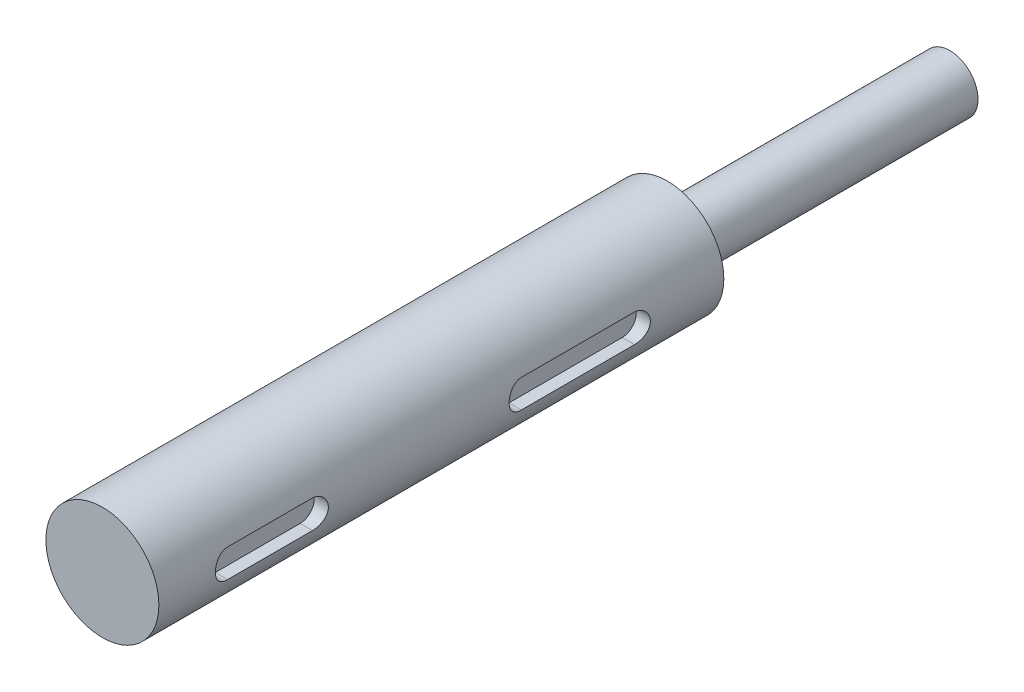
ISO-10303-21;
HEADER;
FILE_DESCRIPTION(('STEP AP214'),'2;1');
FILE_NAME('part.step','',(''),(''),'','','');
FILE_SCHEMA(('AUTOMOTIVE_DESIGN { 1 0 10303 214 1 1 1 1 }'));
ENDSEC;
DATA;
#1=APPLICATION_CONTEXT('core data for automotive mechanical design processes');
#2=APPLICATION_PROTOCOL_DEFINITION('international standard','automotive_design',2000,#1);
#3=PRODUCT_CONTEXT('',#1,'mechanical');
#4=PRODUCT('Part','Part','',(#3));
#5=PRODUCT_RELATED_PRODUCT_CATEGORY('part','',(#4));
#6=PRODUCT_DEFINITION_FORMATION('','',#4);
#7=PRODUCT_DEFINITION_CONTEXT('part definition',#1,'design');
#8=PRODUCT_DEFINITION('design','',#6,#7);
#9=PRODUCT_DEFINITION_SHAPE('','',#8);
#10=(LENGTH_UNIT() NAMED_UNIT(*) SI_UNIT(.MILLI.,.METRE.));
#11=(NAMED_UNIT(*) PLANE_ANGLE_UNIT() SI_UNIT($,.RADIAN.));
#12=(NAMED_UNIT(*) SI_UNIT($,.STERADIAN.) SOLID_ANGLE_UNIT());
#13=UNCERTAINTY_MEASURE_WITH_UNIT(LENGTH_MEASURE(1.E-05),#10,'distance_accuracy_value','');
#14=(GEOMETRIC_REPRESENTATION_CONTEXT(3) GLOBAL_UNCERTAINTY_ASSIGNED_CONTEXT((#13)) GLOBAL_UNIT_ASSIGNED_CONTEXT((#10,
#11,#12)) REPRESENTATION_CONTEXT('',''));
#15=CARTESIAN_POINT('',(0.,0.,0.));
#16=DIRECTION('',(0.,0.,1.));
#17=DIRECTION('',(1.,0.,0.));
#18=AXIS2_PLACEMENT_3D('',#15,#16,#17);
#19=CARTESIAN_POINT('',(0.,0.,40.));
#20=DIRECTION('',(0.,0.,-1.));
#21=DIRECTION('',(-1.,0.,0.));
#22=AXIS2_PLACEMENT_3D('',#19,#20,#21);
#23=CYLINDRICAL_SURFACE('',#22,4.);
#24=CARTESIAN_POINT('',(0.,0.,40.));
#25=DIRECTION('',(0.,0.,1.));
#26=DIRECTION('',(1.,0.,0.));
#27=AXIS2_PLACEMENT_3D('',#24,#25,#26);
#28=CIRCLE('',#27,4.);
#29=CARTESIAN_POINT('',(4.,0.,40.));
#30=VERTEX_POINT('',#29);
#31=EDGE_CURVE('E181',#30,#30,#28,.T.);
#32=ORIENTED_EDGE('',*,*,#31,.F.);
#33=EDGE_LOOP('',(#32));
#34=FACE_BOUND('',#33,.T.);
#35=CARTESIAN_POINT('',(0.,0.,0.));
#36=DIRECTION('',(0.,0.,1.));
#37=DIRECTION('',(1.,0.,0.));
#38=AXIS2_PLACEMENT_3D('',#35,#36,#37);
#39=CIRCLE('',#38,4.);
#40=CARTESIAN_POINT('',(4.,0.,0.));
#41=VERTEX_POINT('',#40);
#42=EDGE_CURVE('E175',#41,#41,#39,.T.);
#43=ORIENTED_EDGE('',*,*,#42,.T.);
#44=EDGE_LOOP('',(#43));
#45=FACE_BOUND('',#44,.T.);
#46=DIRECTION('',(0.,0.,-1.));
#47=VECTOR('',#46,1.);
#48=CARTESIAN_POINT('',(3.87298334620741,-1.00000000000001,40.));
#49=LINE('',#48,#47);
#50=CARTESIAN_POINT('',(3.87298334620741,-1.,14.2));
#51=VERTEX_POINT('',#50);
#52=CARTESIAN_POINT('',(3.87298334620742,-1.,6.2));
#53=VERTEX_POINT('',#52);
#54=EDGE_CURVE('E248',#51,#53,#49,.T.);
#55=ORIENTED_EDGE('',*,*,#54,.F.);
#56=CARTESIAN_POINT('',(4.,0.,15.2));
#57=CARTESIAN_POINT('',(3.99999906578675,-0.0552507257798222,15.1999984495079));
#58=CARTESIAN_POINT('',(3.99884385421219,-0.110518771887177,15.1954056328175));
#59=CARTESIAN_POINT('',(3.99434742553261,-0.21947088251369,15.177183232462));
#60=CARTESIAN_POINT('',(3.99100496946645,-0.273154031247161,15.1635485269748));
#61=CARTESIAN_POINT('',(3.98250417554693,-0.37734724812172,15.1277071643586));
#62=CARTESIAN_POINT('',(3.97734801894724,-0.42786104228667,15.1055108008565));
#63=CARTESIAN_POINT('',(3.96576895871728,-0.524448087936286,15.0532124066368));
#64=CARTESIAN_POINT('',(3.95934601236033,-0.570521189565841,15.023110109254));
#65=CARTESIAN_POINT('',(3.94578275727867,-0.657867951533948,14.9551994735639));
#66=CARTESIAN_POINT('',(3.93863138099022,-0.699037126707382,14.9172589500272));
#67=CARTESIAN_POINT('',(3.92449080078353,-0.774499284802204,14.8350318633941));
#68=CARTESIAN_POINT('',(3.91750161525565,-0.808791491299425,14.7907445847023));
#69=CARTESIAN_POINT('',(3.9043651713314,-0.870017695199357,14.6962698488417));
#70=CARTESIAN_POINT('',(3.89823196313737,-0.896834810616906,14.6460045127931));
#71=CARTESIAN_POINT('',(3.88766329874815,-0.941597939033687,14.5415010588944));
#72=CARTESIAN_POINT('',(3.88322757115192,-0.95954537029289,14.4872635777828));
#73=CARTESIAN_POINT('',(3.87666984478367,-0.985703224536195,14.3775043345317));
#74=CARTESIAN_POINT('',(3.87450327383617,-0.994101512222227,14.3220300693001));
#75=CARTESIAN_POINT('',(3.8725957502516,-1.00150785004524,14.2104209539907));
#76=CARTESIAN_POINT('',(3.87285440299096,-1.00051742787865,14.1542862128676));
#77=CARTESIAN_POINT('',(3.87572803664412,-0.989324349759522,14.0443894615037));
#78=CARTESIAN_POINT('',(3.87828575334586,-0.979345560127015,13.9906029190233));
#79=CARTESIAN_POINT('',(3.88537806450989,-0.950816124602073,13.8854926327258));
#80=CARTESIAN_POINT('',(3.88991279980464,-0.932264868046284,13.8341690646473));
#81=CARTESIAN_POINT('',(3.90050075936124,-0.886926318624771,13.7348413224986));
#82=CARTESIAN_POINT('',(3.90656884979614,-0.860057778155276,13.6868758854736));
#83=CARTESIAN_POINT('',(3.91953140564257,-0.798904184009971,13.5960541934954));
#84=CARTESIAN_POINT('',(3.9264260155649,-0.764617832539227,13.5531988346218));
#85=CARTESIAN_POINT('',(3.94050587026521,-0.688442283120812,13.4725309228704));
#86=CARTESIAN_POINT('',(3.94769379651981,-0.646364172110574,13.4348970066258));
#87=CARTESIAN_POINT('',(3.96137310385857,-0.556407945002467,13.3671858383574));
#88=CARTESIAN_POINT('',(3.96786446366277,-0.508529651805296,13.3371088171576));
#89=CARTESIAN_POINT('',(3.97945154729455,-0.408077259120928,13.2852996091837));
#90=CARTESIAN_POINT('',(3.9845424008515,-0.355487595472417,13.2635964398304));
#91=CARTESIAN_POINT('',(3.99271944660945,-0.247250672095256,13.2293884628603));
#92=CARTESIAN_POINT('',(3.99580602226187,-0.191603999433657,13.2168818957212));
#93=CARTESIAN_POINT('',(3.9995699951425,-0.0803599802600182,13.2016949562941));
#94=CARTESIAN_POINT('',(4.00030702338852,-0.0247978133254736,13.1987713159498));
#95=CARTESIAN_POINT('',(3.999458698763,0.0860219165343381,13.2021660013703));
#96=CARTESIAN_POINT('',(3.99787355494564,0.141279506429729,13.2084834951994));
#97=CARTESIAN_POINT('',(3.99259720751571,0.249076179184327,13.2299806055943));
#98=CARTESIAN_POINT('',(3.98893756123874,0.301643412645835,13.2450275089847));
#99=CARTESIAN_POINT('',(3.97992471089423,0.403504861635006,13.2834047226856));
#100=CARTESIAN_POINT('',(3.97457133579928,0.452798746021755,13.3067358695421));
#101=CARTESIAN_POINT('',(3.96262205284207,0.547682089619897,13.3614907525832));
#102=CARTESIAN_POINT('',(3.95600578244621,0.593190294557219,13.3930507415978));
#103=CARTESIAN_POINT('',(3.94229672791613,0.678351075762163,13.4631932725313));
#104=CARTESIAN_POINT('',(3.93520386167803,0.718002639315338,13.5017770264113));
#105=CARTESIAN_POINT('',(3.92112637973847,0.79132704538182,13.5860013072296));
#106=CARTESIAN_POINT('',(3.91414869458187,0.824829245081354,13.6317918020016));
#107=CARTESIAN_POINT('',(3.90128585584826,0.883673839341797,13.7284884229771));
#108=CARTESIAN_POINT('',(3.89540065378017,0.909016596105289,13.7793943219732));
#109=CARTESIAN_POINT('',(3.88545396489777,0.950634280406193,13.8846038149421));
#110=CARTESIAN_POINT('',(3.88138170194604,0.966962931102708,13.9388850855627));
#111=CARTESIAN_POINT('',(3.87551162726789,0.990230439969184,14.0495397585927));
#112=CARTESIAN_POINT('',(3.87371331813291,0.997171351652437,14.1059127006883));
#113=CARTESIAN_POINT('',(3.87263267469304,1.00135906022266,14.2174140159035));
#114=CARTESIAN_POINT('',(3.87327955152176,0.998878598520077,14.2725316234165));
#115=CARTESIAN_POINT('',(3.87685272671895,0.98491818554191,14.3815359257787));
#116=CARTESIAN_POINT('',(3.87977897927904,0.973438415124511,14.4354226453424));
#117=CARTESIAN_POINT('',(3.88754173788482,0.94195421296186,14.5401389727103));
#118=CARTESIAN_POINT('',(3.89236676824206,0.922000936453581,14.5909848701601));
#119=CARTESIAN_POINT('',(3.90338503816552,0.874176609070045,14.6886435884758));
#120=CARTESIAN_POINT('',(3.90957846747182,0.84630446002279,14.7354558487913));
#121=CARTESIAN_POINT('',(3.92283756175675,0.782578499091421,14.8250364193347));
#122=CARTESIAN_POINT('',(3.92992176554505,0.746535441941499,14.8676673822826));
#123=CARTESIAN_POINT('',(3.94405351497524,0.667859580793153,14.9463646965303));
#124=CARTESIAN_POINT('',(3.95110105151373,0.625225214174094,14.982429486742));
#125=CARTESIAN_POINT('',(3.96451770431775,0.533645057801725,15.0476075390431));
#126=CARTESIAN_POINT('',(3.97087222243912,0.484598948210922,15.0765830757811));
#127=CARTESIAN_POINT('',(3.98203283316745,0.382177373006982,15.1258316419604));
#128=CARTESIAN_POINT('',(3.98684003466521,0.328805042291158,15.146110907099));
#129=CARTESIAN_POINT('',(3.99365373043694,0.229606835495646,15.1743812202198));
#130=CARTESIAN_POINT('',(3.9960172336846,0.184253447272044,15.183967495369));
#131=CARTESIAN_POINT('',(3.99919070154632,0.0926040476908542,15.196777295748));
#132=CARTESIAN_POINT('',(4.00000078300596,0.0463081074950761,15.2000012995369));
#133=CARTESIAN_POINT('',(4.,0.,15.2));
#134=B_SPLINE_CURVE_WITH_KNOTS('',3,(#56,#57,#58,#59,#60,#61,#62,#63,#64,#65,#66,#67,#68,#69,
#70,#71,#72,#73,#74,#75,#76,#77,#78,#79,#80,#81,#82,#83,#84,#85,#86,#87,#88,#89,#90,#91,#92,#93,
#94,#95,#96,#97,#98,#99,#100,#101,#102,#103,#104,#105,#106,#107,#108,#109,#110,#111,#112,#113,
#114,#115,#116,#117,#118,#119,#120,#121,#122,#123,#124,#125,#126,#127,#128,#129,#130,#131,#132,
#133),.UNSPECIFIED.,.T.,.F.,(4,2,2,2,2,2,2,2,2,2,2,2,2,2,2,2,2,2,2,2,2,2,2,2,2,2,2,2,2,2,2,2,2,
2,2,2,2,2,4),(0.,0.16558247498126,0.331258825175933,0.49673660152407,0.662219960112885,
0.830762902914261,0.999324863867079,1.17039098363871,1.34142974112912,1.50904196732954,
1.67662692075131,1.84014998004679,2.00368468977359,2.16887018582586,2.33408460557442,
2.50401000646013,2.67394059705498,2.84445486006076,3.01493649125762,3.18105539299518,
3.34715934075162,3.51080183009358,3.67446084881527,3.84102391710235,4.00761575338679,
4.17829672802984,4.34897012499672,4.51861503076024,4.68822282168272,4.85295853599075,
5.0176909397069,5.18144267039631,5.34521712091267,5.51326384273274,5.68135046513612,
5.85248123666392,6.02348909214233,6.16228161961432,6.3010637069536),.UNSPECIFIED.);
#135=CARTESIAN_POINT('',(3.87298334620742,0.999999999999998,14.2));
#136=VERTEX_POINT('',#135);
#137=EDGE_CURVE('E194',#136,#51,#134,.T.);
#138=ORIENTED_EDGE('',*,*,#137,.F.);
#139=DIRECTION('',(0.,0.,-1.));
#140=VECTOR('',#139,1.);
#141=CARTESIAN_POINT('',(3.87298334620742,0.999999999999991,40.));
#142=LINE('',#141,#140);
#143=CARTESIAN_POINT('',(3.87298334620742,1.,6.2));
#144=VERTEX_POINT('',#143);
#145=EDGE_CURVE('E283',#144,#136,#142,.F.);
#146=ORIENTED_EDGE('',*,*,#145,.F.);
#147=CARTESIAN_POINT('',(4.,0.,7.2));
#148=CARTESIAN_POINT('',(3.99999906578675,-0.0552507257798204,7.19999844950789));
#149=CARTESIAN_POINT('',(3.99884385421219,-0.110518771887175,7.19540563281747));
#150=CARTESIAN_POINT('',(3.99434742553261,-0.219470882513688,7.177183232462));
#151=CARTESIAN_POINT('',(3.99100496946645,-0.273154031247159,7.16354852697477));
#152=CARTESIAN_POINT('',(3.98250417554693,-0.377347248121718,7.12770716435861));
#153=CARTESIAN_POINT('',(3.97734801894724,-0.427861042286669,7.10551080085648));
#154=CARTESIAN_POINT('',(3.96576895871729,-0.524448087936285,7.05321240663678));
#155=CARTESIAN_POINT('',(3.95934601236034,-0.57052118956584,7.02311010925404));
#156=CARTESIAN_POINT('',(3.94578275727867,-0.657867951533947,6.95519947356386));
#157=CARTESIAN_POINT('',(3.93863138099022,-0.699037126707381,6.91725895002721));
#158=CARTESIAN_POINT('',(3.92449080078353,-0.774499284802203,6.83503186339405));
#159=CARTESIAN_POINT('',(3.91750161525565,-0.808791491299423,6.79074458470234));
#160=CARTESIAN_POINT('',(3.9043651713314,-0.870017695199355,6.69626984884171));
#161=CARTESIAN_POINT('',(3.89823196313737,-0.896834810616904,6.64600451279306));
#162=CARTESIAN_POINT('',(3.88766329874815,-0.941597939033685,6.54150105889443));
#163=CARTESIAN_POINT('',(3.88322757115192,-0.959545370292889,6.48726357778282));
#164=CARTESIAN_POINT('',(3.87666984478367,-0.985703224536194,6.37750433453168));
#165=CARTESIAN_POINT('',(3.87450327383617,-0.994101512222225,6.32203006930013));
#166=CARTESIAN_POINT('',(3.8725957502516,-1.00150785004523,6.21042095399068));
#167=CARTESIAN_POINT('',(3.87285440299096,-1.00051742787865,6.15428621286759));
#168=CARTESIAN_POINT('',(3.87572803664412,-0.98932434975952,6.04438946150368));
#169=CARTESIAN_POINT('',(3.87828575334586,-0.979345560127013,5.99060291902327));
#170=CARTESIAN_POINT('',(3.88537806450989,-0.950816124602071,5.8854926327258));
#171=CARTESIAN_POINT('',(3.88991279980464,-0.932264868046282,5.83416906464734));
#172=CARTESIAN_POINT('',(3.90050075936124,-0.886926318624769,5.73484132249862));
#173=CARTESIAN_POINT('',(3.90656884979614,-0.860057778155274,5.68687588547363));
#174=CARTESIAN_POINT('',(3.91953140564257,-0.798904184009969,5.59605419349544));
#175=CARTESIAN_POINT('',(3.9264260155649,-0.764617832539226,5.55319883462183));
#176=CARTESIAN_POINT('',(3.94050587026521,-0.688442283120812,5.4725309228704));
#177=CARTESIAN_POINT('',(3.94769379651981,-0.646364172110574,5.43489700662577));
#178=CARTESIAN_POINT('',(3.96137310385857,-0.556407945002467,5.3671858383574));
#179=CARTESIAN_POINT('',(3.96786446366277,-0.508529651805296,5.33710881715762));
#180=CARTESIAN_POINT('',(3.97945154729455,-0.408077259120928,5.28529960918374));
#181=CARTESIAN_POINT('',(3.9845424008515,-0.355487595472415,5.26359643983038));
#182=CARTESIAN_POINT('',(3.99271944660945,-0.247250672095255,5.22938846286028));
#183=CARTESIAN_POINT('',(3.99580602226187,-0.191603999433656,5.21688189572124));
#184=CARTESIAN_POINT('',(3.9995699951425,-0.0803599802600173,5.20169495629411));
#185=CARTESIAN_POINT('',(4.00030702338852,-0.0247978133254728,5.1987713159498));
#186=CARTESIAN_POINT('',(3.999458698763,0.086021916534339,5.20216600137032));
#187=CARTESIAN_POINT('',(3.99787355494564,0.14127950642973,5.20848349519942));
#188=CARTESIAN_POINT('',(3.99259720751571,0.249076179184328,5.22998060559425));
#189=CARTESIAN_POINT('',(3.98893756123874,0.301643412645837,5.24502750898466));
#190=CARTESIAN_POINT('',(3.97992471089423,0.403504861635008,5.28340472268563));
#191=CARTESIAN_POINT('',(3.97457133579928,0.452798746021757,5.30673586954211));
#192=CARTESIAN_POINT('',(3.96262205284207,0.547682089619899,5.36149075258315));
#193=CARTESIAN_POINT('',(3.95600578244621,0.593190294557221,5.39305074159784));
#194=CARTESIAN_POINT('',(3.94229672791613,0.678351075762164,5.46319327253131));
#195=CARTESIAN_POINT('',(3.93520386167803,0.718002639315339,5.50177702641127));
#196=CARTESIAN_POINT('',(3.92112637973847,0.791327045381821,5.58600130722964));
#197=CARTESIAN_POINT('',(3.91414869458187,0.824829245081355,5.63179180200161));
#198=CARTESIAN_POINT('',(3.90128585584826,0.883673839341799,5.72848842297714));
#199=CARTESIAN_POINT('',(3.89540065378017,0.909016596105291,5.77939432197317));
#200=CARTESIAN_POINT('',(3.88545396489777,0.950634280406195,5.88460381494205));
#201=CARTESIAN_POINT('',(3.88138170194604,0.966962931102711,5.93888508556267));
#202=CARTESIAN_POINT('',(3.87551162726789,0.990230439969186,6.04953975859274));
#203=CARTESIAN_POINT('',(3.87371331813291,0.997171351652439,6.10591270068833));
#204=CARTESIAN_POINT('',(3.87263267469304,1.00135906022266,6.21741401590347));
#205=CARTESIAN_POINT('',(3.87327955152176,0.998878598520079,6.27253162341649));
#206=CARTESIAN_POINT('',(3.87685272671895,0.984918185541912,6.38153592577865));
#207=CARTESIAN_POINT('',(3.87977897927904,0.973438415124514,6.43542264534243));
#208=CARTESIAN_POINT('',(3.88754173788482,0.941954212961864,6.54013897271027));
#209=CARTESIAN_POINT('',(3.89236676824206,0.922000936453584,6.59098487016014));
#210=CARTESIAN_POINT('',(3.90338503816552,0.874176609070048,6.68864358847579));
#211=CARTESIAN_POINT('',(3.90957846747182,0.846304460022793,6.73545584879128));
#212=CARTESIAN_POINT('',(3.92283756175675,0.782578499091424,6.82503641933468));
#213=CARTESIAN_POINT('',(3.92992176554505,0.746535441941503,6.86766738228264));
#214=CARTESIAN_POINT('',(3.94405351497524,0.667859580793158,6.94636469653027));
#215=CARTESIAN_POINT('',(3.95110105151373,0.625225214174098,6.98242948674198));
#216=CARTESIAN_POINT('',(3.96451770431775,0.533645057801728,7.04760753904307));
#217=CARTESIAN_POINT('',(3.97087222243912,0.484598948210925,7.07658307578105));
#218=CARTESIAN_POINT('',(3.98203283316746,0.382177373006985,7.12583164196035));
#219=CARTESIAN_POINT('',(3.98684003466521,0.32880504229116,7.14611090709902));
#220=CARTESIAN_POINT('',(3.99365373043694,0.229606835495648,7.17438122021977));
#221=CARTESIAN_POINT('',(3.9960172336846,0.184253447272046,7.18396749536896));
#222=CARTESIAN_POINT('',(3.99919070154632,0.0926040476908557,7.19677729574796));
#223=CARTESIAN_POINT('',(4.00000078300596,0.0463081074950778,7.20000129953687));
#224=CARTESIAN_POINT('',(4.,0.,7.2));
#225=B_SPLINE_CURVE_WITH_KNOTS('',3,(#147,#148,#149,#150,#151,#152,#153,#154,#155,#156,#157,
#158,#159,#160,#161,#162,#163,#164,#165,#166,#167,#168,#169,#170,#171,#172,#173,#174,#175,#176,
#177,#178,#179,#180,#181,#182,#183,#184,#185,#186,#187,#188,#189,#190,#191,#192,#193,#194,#195,
#196,#197,#198,#199,#200,#201,#202,#203,#204,#205,#206,#207,#208,#209,#210,#211,#212,#213,#214,
#215,#216,#217,#218,#219,#220,#221,#222,#223,#224),.UNSPECIFIED.,.T.,.F.,(4,2,2,2,2,2,2,2,2,2,2,
2,2,2,2,2,2,2,2,2,2,2,2,2,2,2,2,2,2,2,2,2,2,2,2,2,2,2,4),(0.,0.16558247498126,0.331258825175933,
0.496736601524071,0.662219960112886,0.83076290291426,0.999324863867079,1.17039098363871,
1.34142974112912,1.50904196732954,1.67662692075131,1.84014998004679,2.00368468977359,
2.16887018582586,2.33408460557442,2.50401000646013,2.67394059705498,2.84445486006076,
3.01493649125762,3.18105539299518,3.34715934075162,3.51080183009358,3.67446084881527,
3.84102391710235,4.00761575338679,4.17829672802984,4.34897012499672,4.51861503076024,
4.68822282168272,4.85295853599075,5.0176909397069,5.18144267039632,5.34521712091268,
5.51326384273274,5.68135046513612,5.85248123666392,6.02348909214233,6.16228161961433,
6.3010637069536),.UNSPECIFIED.);
#226=EDGE_CURVE('E180',#53,#144,#225,.T.);
#227=ORIENTED_EDGE('',*,*,#226,.F.);
#228=EDGE_LOOP('',(#55,#138,#146,#227));
#229=FACE_BOUND('',#228,.T.);
#230=DIRECTION('',(0.,0.,-1.));
#231=VECTOR('',#230,1.);
#232=CARTESIAN_POINT('',(3.87298334620741,-1.00000000000001,40.));
#233=LINE('',#232,#231);
#234=CARTESIAN_POINT('',(3.87298334620741,-1.,35.));
#235=VERTEX_POINT('',#234);
#236=CARTESIAN_POINT('',(3.87298334620742,-1.,29.));
#237=VERTEX_POINT('',#236);
#238=EDGE_CURVE('E11',#235,#237,#233,.T.);
#239=ORIENTED_EDGE('',*,*,#238,.F.);
#240=CARTESIAN_POINT('',(4.,0.,36.));
#241=CARTESIAN_POINT('',(3.99999906578675,-0.0552507257798242,35.9999984495079));
#242=CARTESIAN_POINT('',(3.99884385421219,-0.110518771887179,35.9954056328175));
#243=CARTESIAN_POINT('',(3.99434742553261,-0.219470882513692,35.977183232462));
#244=CARTESIAN_POINT('',(3.99100496946645,-0.273154031247162,35.9635485269748));
#245=CARTESIAN_POINT('',(3.98250417554693,-0.377347248121721,35.9277071643586));
#246=CARTESIAN_POINT('',(3.97734801894724,-0.427861042286673,35.9055108008565));
#247=CARTESIAN_POINT('',(3.96576895871728,-0.524448087936288,35.8532124066368));
#248=CARTESIAN_POINT('',(3.95934601236034,-0.570521189565842,35.823110109254));
#249=CARTESIAN_POINT('',(3.94578275727867,-0.657867951533948,35.7551994735639));
#250=CARTESIAN_POINT('',(3.93863138099022,-0.699037126707384,35.7172589500272));
#251=CARTESIAN_POINT('',(3.92449080078353,-0.774499284802207,35.6350318633941));
#252=CARTESIAN_POINT('',(3.91750161525565,-0.808791491299428,35.5907445847023));
#253=CARTESIAN_POINT('',(3.9043651713314,-0.87001769519936,35.4962698488417));
#254=CARTESIAN_POINT('',(3.89823196313736,-0.896834810616909,35.4460045127931));
#255=CARTESIAN_POINT('',(3.88766329874815,-0.941597939033688,35.3415010588944));
#256=CARTESIAN_POINT('',(3.88322757115192,-0.959545370292892,35.2872635777828));
#257=CARTESIAN_POINT('',(3.87666984478367,-0.985703224536198,35.1775043345317));
#258=CARTESIAN_POINT('',(3.87450327383617,-0.99410151222223,35.1220300693001));
#259=CARTESIAN_POINT('',(3.8725957502516,-1.00150785004524,35.0104209539907));
#260=CARTESIAN_POINT('',(3.87285440299096,-1.00051742787866,34.9542862128676));
#261=CARTESIAN_POINT('',(3.87572803664412,-0.989324349759524,34.8443894615037));
#262=CARTESIAN_POINT('',(3.87828575334586,-0.979345560127016,34.7906029190233));
#263=CARTESIAN_POINT('',(3.88537806450989,-0.950816124602074,34.6854926327258));
#264=CARTESIAN_POINT('',(3.88991279980464,-0.932264868046286,34.6341690646473));
#265=CARTESIAN_POINT('',(3.90050075936124,-0.886926318624773,34.5348413224986));
#266=CARTESIAN_POINT('',(3.90656884979614,-0.860057778155277,34.4868758854736));
#267=CARTESIAN_POINT('',(3.91953140564257,-0.798904184009973,34.3960541934954));
#268=CARTESIAN_POINT('',(3.9264260155649,-0.76461783253923,34.3531988346218));
#269=CARTESIAN_POINT('',(3.9405058702652,-0.688442283120817,34.2725309228704));
#270=CARTESIAN_POINT('',(3.94769379651981,-0.646364172110579,34.2348970066258));
#271=CARTESIAN_POINT('',(3.96137310385857,-0.556407945002473,34.1671858383574));
#272=CARTESIAN_POINT('',(3.96786446366277,-0.508529651805303,34.1371088171576));
#273=CARTESIAN_POINT('',(3.97945154729455,-0.408077259120934,34.0852996091837));
#274=CARTESIAN_POINT('',(3.9845424008515,-0.355487595472421,34.0635964398304));
#275=CARTESIAN_POINT('',(3.99271944660945,-0.247250672095259,34.0293884628603));
#276=CARTESIAN_POINT('',(3.99580602226187,-0.191603999433659,34.0168818957212));
#277=CARTESIAN_POINT('',(3.9995699951425,-0.0803599802600198,34.0016949562941));
#278=CARTESIAN_POINT('',(4.00030702338852,-0.0247978133254754,33.9987713159498));
#279=CARTESIAN_POINT('',(3.999458698763,0.0860219165343356,34.0021660013703));
#280=CARTESIAN_POINT('',(3.99787355494564,0.141279506429726,34.0084834951994));
#281=CARTESIAN_POINT('',(3.99259720751571,0.249076179184324,34.0299806055943));
#282=CARTESIAN_POINT('',(3.98893756123874,0.301643412645833,34.0450275089847));
#283=CARTESIAN_POINT('',(3.97992471089423,0.403504861635004,34.0834047226856));
#284=CARTESIAN_POINT('',(3.97457133579928,0.452798746021752,34.1067358695421));
#285=CARTESIAN_POINT('',(3.96262205284207,0.547682089619894,34.1614907525831));
#286=CARTESIAN_POINT('',(3.95600578244621,0.593190294557216,34.1930507415978));
#287=CARTESIAN_POINT('',(3.94229672791613,0.678351075762161,34.2631932725313));
#288=CARTESIAN_POINT('',(3.93520386167803,0.718002639315335,34.3017770264113));
#289=CARTESIAN_POINT('',(3.92112637973847,0.791327045381817,34.3860013072296));
#290=CARTESIAN_POINT('',(3.91414869458187,0.824829245081351,34.4317918020016));
#291=CARTESIAN_POINT('',(3.90128585584826,0.883673839341793,34.5284884229771));
#292=CARTESIAN_POINT('',(3.89540065378017,0.909016596105285,34.5793943219732));
#293=CARTESIAN_POINT('',(3.88545396489777,0.95063428040619,34.6846038149421));
#294=CARTESIAN_POINT('',(3.88138170194604,0.966962931102706,34.7388850855627));
#295=CARTESIAN_POINT('',(3.87551162726789,0.990230439969183,34.8495397585927));
#296=CARTESIAN_POINT('',(3.87371331813291,0.997171351652435,34.9059127006883));
#297=CARTESIAN_POINT('',(3.87263267469304,1.00135906022266,35.0174140159035));
#298=CARTESIAN_POINT('',(3.87327955152176,0.998878598520077,35.0725316234165));
#299=CARTESIAN_POINT('',(3.87685272671895,0.984918185541911,35.1815359257786));
#300=CARTESIAN_POINT('',(3.87977897927904,0.973438415124511,35.2354226453424));
#301=CARTESIAN_POINT('',(3.88754173788482,0.941954212961861,35.3401389727103));
#302=CARTESIAN_POINT('',(3.89236676824206,0.922000936453583,35.3909848701601));
#303=CARTESIAN_POINT('',(3.90338503816552,0.874176609070048,35.4886435884758));
#304=CARTESIAN_POINT('',(3.90957846747182,0.846304460022794,35.5354558487913));
#305=CARTESIAN_POINT('',(3.92283756175675,0.782578499091426,35.6250364193347));
#306=CARTESIAN_POINT('',(3.92992176554505,0.746535441941505,35.6676673822826));
#307=CARTESIAN_POINT('',(3.94405351497524,0.667859580793157,35.7463646965303));
#308=CARTESIAN_POINT('',(3.95110105151373,0.625225214174095,35.782429486742));
#309=CARTESIAN_POINT('',(3.96451770431775,0.533645057801723,35.8476075390431));
#310=CARTESIAN_POINT('',(3.97087222243912,0.484598948210922,35.8765830757811));
#311=CARTESIAN_POINT('',(3.98203283316745,0.382177373006982,35.9258316419604));
#312=CARTESIAN_POINT('',(3.98684003466521,0.328805042291157,35.946110907099));
#313=CARTESIAN_POINT('',(3.99365373043694,0.229606835495644,35.9743812202198));
#314=CARTESIAN_POINT('',(3.9960172336846,0.184253447272042,35.983967495369));
#315=CARTESIAN_POINT('',(3.99919070154632,0.0926040476908519,35.996777295748));
#316=CARTESIAN_POINT('',(4.00000078300596,0.0463081074950741,36.0000012995369));
#317=CARTESIAN_POINT('',(4.,0.,36.));
#318=B_SPLINE_CURVE_WITH_KNOTS('',3,(#240,#241,#242,#243,#244,#245,#246,#247,#248,#249,#250,
#251,#252,#253,#254,#255,#256,#257,#258,#259,#260,#261,#262,#263,#264,#265,#266,#267,#268,#269,
#270,#271,#272,#273,#274,#275,#276,#277,#278,#279,#280,#281,#282,#283,#284,#285,#286,#287,#288,
#289,#290,#291,#292,#293,#294,#295,#296,#297,#298,#299,#300,#301,#302,#303,#304,#305,#306,#307,
#308,#309,#310,#311,#312,#313,#314,#315,#316,#317),.UNSPECIFIED.,.T.,.F.,(4,2,2,2,2,2,2,2,2,2,2,
2,2,2,2,2,2,2,2,2,2,2,2,2,2,2,2,2,2,2,2,2,2,2,2,2,2,2,4),(0.,0.16558247498126,0.331258825175933,
0.496736601524071,0.662219960112883,0.830762902914264,0.999324863867079,1.17039098363872,
1.34142974112912,1.50904196732954,1.67662692075131,1.84014998004679,2.00368468977359,
2.16887018582587,2.33408460557442,2.50401000646013,2.67394059705498,2.84445486006076,
3.01493649125762,3.18105539299518,3.34715934075162,3.51080183009358,3.67446084881527,
3.84102391710234,4.00761575338679,4.17829672802984,4.34897012499672,4.51861503076024,
4.68822282168271,4.85295853599074,5.01769093970689,5.1814426703963,5.34521712091267,
5.51326384273273,5.68135046513612,5.85248123666392,6.02348909214233,6.16228161961433,
6.3010637069536),.UNSPECIFIED.);
#319=CARTESIAN_POINT('',(3.87298334620742,0.999999999999996,35.));
#320=VERTEX_POINT('',#319);
#321=EDGE_CURVE('E111',#320,#235,#318,.T.);
#322=ORIENTED_EDGE('',*,*,#321,.F.);
#323=DIRECTION('',(0.,0.,-1.));
#324=VECTOR('',#323,1.);
#325=CARTESIAN_POINT('',(3.87298334620742,0.999999999999995,40.));
#326=LINE('',#325,#324);
#327=CARTESIAN_POINT('',(3.87298334620742,0.999999999999998,29.));
#328=VERTEX_POINT('',#327);
#329=EDGE_CURVE('E47',#328,#320,#326,.F.);
#330=ORIENTED_EDGE('',*,*,#329,.F.);
#331=CARTESIAN_POINT('',(4.,0.,30.));
#332=CARTESIAN_POINT('',(3.99999906578675,-0.0552507257798235,29.9999984495079));
#333=CARTESIAN_POINT('',(3.99884385421219,-0.110518771887178,29.9954056328175));
#334=CARTESIAN_POINT('',(3.99434742553261,-0.219470882513691,29.977183232462));
#335=CARTESIAN_POINT('',(3.99100496946645,-0.273154031247162,29.9635485269748));
#336=CARTESIAN_POINT('',(3.98250417554693,-0.377347248121722,29.9277071643586));
#337=CARTESIAN_POINT('',(3.97734801894724,-0.427861042286674,29.9055108008565));
#338=CARTESIAN_POINT('',(3.96576895871728,-0.52444808793629,29.8532124066368));
#339=CARTESIAN_POINT('',(3.95934601236033,-0.570521189565844,29.823110109254));
#340=CARTESIAN_POINT('',(3.94578275727867,-0.657867951533951,29.7551994735639));
#341=CARTESIAN_POINT('',(3.93863138099022,-0.699037126707386,29.7172589500272));
#342=CARTESIAN_POINT('',(3.92449080078353,-0.774499284802207,29.6350318633941));
#343=CARTESIAN_POINT('',(3.91750161525565,-0.808791491299427,29.5907445847023));
#344=CARTESIAN_POINT('',(3.9043651713314,-0.870017695199357,29.4962698488417));
#345=CARTESIAN_POINT('',(3.89823196313737,-0.896834810616906,29.4460045127931));
#346=CARTESIAN_POINT('',(3.88766329874815,-0.941597939033687,29.3415010588944));
#347=CARTESIAN_POINT('',(3.88322757115192,-0.959545370292891,29.2872635777828));
#348=CARTESIAN_POINT('',(3.87666984478367,-0.985703224536197,29.1775043345317));
#349=CARTESIAN_POINT('',(3.87450327383617,-0.994101512222229,29.1220300693001));
#350=CARTESIAN_POINT('',(3.8725957502516,-1.00150785004524,29.0104209539907));
#351=CARTESIAN_POINT('',(3.87285440299096,-1.00051742787865,28.9542862128676));
#352=CARTESIAN_POINT('',(3.87572803664412,-0.989324349759523,28.8443894615037));
#353=CARTESIAN_POINT('',(3.87828575334586,-0.979345560127016,28.7906029190233));
#354=CARTESIAN_POINT('',(3.88537806450989,-0.950816124602074,28.6854926327258));
#355=CARTESIAN_POINT('',(3.88991279980464,-0.932264868046285,28.6341690646473));
#356=CARTESIAN_POINT('',(3.90050075936124,-0.886926318624773,28.5348413224986));
#357=CARTESIAN_POINT('',(3.90656884979614,-0.860057778155278,28.4868758854736));
#358=CARTESIAN_POINT('',(3.91953140564257,-0.798904184009974,28.3960541934954));
#359=CARTESIAN_POINT('',(3.9264260155649,-0.764617832539229,28.3531988346218));
#360=CARTESIAN_POINT('',(3.94050587026521,-0.688442283120814,28.2725309228704));
#361=CARTESIAN_POINT('',(3.94769379651981,-0.646364172110576,28.2348970066258));
#362=CARTESIAN_POINT('',(3.96137310385857,-0.55640794500247,28.1671858383574));
#363=CARTESIAN_POINT('',(3.96786446366277,-0.508529651805299,28.1371088171576));
#364=CARTESIAN_POINT('',(3.97945154729455,-0.408077259120931,28.0852996091837));
#365=CARTESIAN_POINT('',(3.9845424008515,-0.355487595472419,28.0635964398304));
#366=CARTESIAN_POINT('',(3.99271944660945,-0.247250672095258,28.0293884628603));
#367=CARTESIAN_POINT('',(3.99580602226187,-0.19160399943366,28.0168818957212));
#368=CARTESIAN_POINT('',(3.9995699951425,-0.0803599802600207,28.0016949562941));
#369=CARTESIAN_POINT('',(4.00030702338852,-0.0247978133254758,27.9987713159498));
#370=CARTESIAN_POINT('',(3.999458698763,0.0860219165343366,28.0021660013703));
#371=CARTESIAN_POINT('',(3.99787355494564,0.141279506429728,28.0084834951994));
#372=CARTESIAN_POINT('',(3.99259720751571,0.249076179184326,28.0299806055943));
#373=CARTESIAN_POINT('',(3.98893756123874,0.301643412645833,28.0450275089847));
#374=CARTESIAN_POINT('',(3.97992471089423,0.403504861635005,28.0834047226856));
#375=CARTESIAN_POINT('',(3.97457133579928,0.452798746021755,28.1067358695421));
#376=CARTESIAN_POINT('',(3.96262205284207,0.547682089619898,28.1614907525832));
#377=CARTESIAN_POINT('',(3.95600578244621,0.59319029455722,28.1930507415978));
#378=CARTESIAN_POINT('',(3.94229672791613,0.678351075762163,28.2631932725313));
#379=CARTESIAN_POINT('',(3.93520386167803,0.718002639315338,28.3017770264113));
#380=CARTESIAN_POINT('',(3.92112637973847,0.791327045381819,28.3860013072296));
#381=CARTESIAN_POINT('',(3.91414869458187,0.824829245081354,28.4317918020016));
#382=CARTESIAN_POINT('',(3.90128585584826,0.883673839341797,28.5284884229772));
#383=CARTESIAN_POINT('',(3.89540065378017,0.90901659610529,28.5793943219732));
#384=CARTESIAN_POINT('',(3.88545396489777,0.950634280406193,28.6846038149421));
#385=CARTESIAN_POINT('',(3.88138170194604,0.966962931102708,28.7388850855627));
#386=CARTESIAN_POINT('',(3.87551162726789,0.990230439969184,28.8495397585927));
#387=CARTESIAN_POINT('',(3.87371331813291,0.997171351652436,28.9059127006883));
#388=CARTESIAN_POINT('',(3.87263267469304,1.00135906022266,29.0174140159035));
#389=CARTESIAN_POINT('',(3.87327955152176,0.998878598520076,29.0725316234165));
#390=CARTESIAN_POINT('',(3.87685272671895,0.984918185541908,29.1815359257787));
#391=CARTESIAN_POINT('',(3.87977897927904,0.97343841512451,29.2354226453424));
#392=CARTESIAN_POINT('',(3.88754173788482,0.941954212961859,29.3401389727103));
#393=CARTESIAN_POINT('',(3.89236676824206,0.92200093645358,29.3909848701601));
#394=CARTESIAN_POINT('',(3.90338503816552,0.874176609070043,29.4886435884758));
#395=CARTESIAN_POINT('',(3.90957846747182,0.846304460022789,29.5354558487913));
#396=CARTESIAN_POINT('',(3.92283756175675,0.782578499091422,29.6250364193347));
#397=CARTESIAN_POINT('',(3.92992176554505,0.746535441941501,29.6676673822826));
#398=CARTESIAN_POINT('',(3.94405351497524,0.667859580793154,29.7463646965303));
#399=CARTESIAN_POINT('',(3.95110105151373,0.625225214174094,29.782429486742));
#400=CARTESIAN_POINT('',(3.96451770431775,0.533645057801723,29.8476075390431));
#401=CARTESIAN_POINT('',(3.97087222243912,0.484598948210921,29.8765830757811));
#402=CARTESIAN_POINT('',(3.98203283316746,0.382177373006981,29.9258316419604));
#403=CARTESIAN_POINT('',(3.98684003466521,0.328805042291158,29.946110907099));
#404=CARTESIAN_POINT('',(3.99365373043694,0.229606835495646,29.9743812202198));
#405=CARTESIAN_POINT('',(3.9960172336846,0.184253447272044,29.983967495369));
#406=CARTESIAN_POINT('',(3.99919070154632,0.092604047690853,29.996777295748));
#407=CARTESIAN_POINT('',(4.00000078300596,0.046308107495075,30.0000012995369));
#408=CARTESIAN_POINT('',(4.,0.,30.));
#409=B_SPLINE_CURVE_WITH_KNOTS('',3,(#331,#332,#333,#334,#335,#336,#337,#338,#339,#340,#341,
#342,#343,#344,#345,#346,#347,#348,#349,#350,#351,#352,#353,#354,#355,#356,#357,#358,#359,#360,
#361,#362,#363,#364,#365,#366,#367,#368,#369,#370,#371,#372,#373,#374,#375,#376,#377,#378,#379,
#380,#381,#382,#383,#384,#385,#386,#387,#388,#389,#390,#391,#392,#393,#394,#395,#396,#397,#398,
#399,#400,#401,#402,#403,#404,#405,#406,#407,#408),.UNSPECIFIED.,.T.,.F.,(4,2,2,2,2,2,2,2,2,2,2,
2,2,2,2,2,2,2,2,2,2,2,2,2,2,2,2,2,2,2,2,2,2,2,2,2,2,2,4),(0.,0.16558247498126,0.331258825175934,
0.496736601524074,0.662219960112887,0.830762902914263,0.99932486386708,1.17039098363871,
1.34142974112912,1.50904196732954,1.67662692075132,1.84014998004679,2.00368468977359,
2.16887018582586,2.33408460557442,2.50401000646013,2.67394059705498,2.84445486006076,
3.01493649125762,3.18105539299518,3.34715934075162,3.51080183009358,3.67446084881527,
3.84102391710235,4.0076157533868,4.17829672802985,4.34897012499673,4.51861503076025,
4.68822282168272,4.85295853599075,5.0176909397069,5.18144267039632,5.34521712091268,
5.51326384273274,5.68135046513612,5.85248123666392,6.02348909214233,6.16228161961433,
6.3010637069536),.UNSPECIFIED.);
#410=EDGE_CURVE('E250',#237,#328,#409,.T.);
#411=ORIENTED_EDGE('',*,*,#410,.F.);
#412=EDGE_LOOP('',(#239,#322,#330,#411));
#413=FACE_BOUND('',#412,.T.);
#414=ADVANCED_FACE('F38',(#34,#45,#229,#413),#23,.T.);
#415=CARTESIAN_POINT('',(0.,0.,40.));
#416=DIRECTION('',(0.,0.,1.));
#417=DIRECTION('',(1.,0.,0.));
#418=AXIS2_PLACEMENT_3D('',#415,#416,#417);
#419=PLANE('',#418);
#420=ORIENTED_EDGE('',*,*,#31,.T.);
#421=EDGE_LOOP('',(#420));
#422=FACE_BOUND('',#421,.T.);
#423=ADVANCED_FACE('F225',(#422),#419,.T.);
#424=CARTESIAN_POINT('',(0.,0.,0.));
#425=DIRECTION('',(0.,0.,1.));
#426=DIRECTION('',(1.,0.,0.));
#427=AXIS2_PLACEMENT_3D('',#424,#425,#426);
#428=PLANE('',#427);
#429=CARTESIAN_POINT('',(0.,0.,0.));
#430=DIRECTION('',(0.,0.,-1.));
#431=DIRECTION('',(-1.,0.,0.));
#432=AXIS2_PLACEMENT_3D('',#429,#430,#431);
#433=CIRCLE('',#432,2.);
#434=CARTESIAN_POINT('',(-2.,0.,0.));
#435=VERTEX_POINT('',#434);
#436=EDGE_CURVE('E176',#435,#435,#433,.T.);
#437=ORIENTED_EDGE('',*,*,#436,.F.);
#438=EDGE_LOOP('',(#437));
#439=FACE_BOUND('',#438,.T.);
#440=ORIENTED_EDGE('',*,*,#42,.F.);
#441=EDGE_LOOP('',(#440));
#442=FACE_BOUND('',#441,.T.);
#443=ADVANCED_FACE('F223',(#439,#442),#428,.F.);
#444=CARTESIAN_POINT('',(0.,0.,-20.));
#445=DIRECTION('',(0.,0.,1.));
#446=DIRECTION('',(1.,0.,0.));
#447=AXIS2_PLACEMENT_3D('',#444,#445,#446);
#448=CYLINDRICAL_SURFACE('',#447,2.);
#449=CARTESIAN_POINT('',(0.,0.,-20.));
#450=DIRECTION('',(0.,0.,-1.));
#451=DIRECTION('',(-1.,0.,0.));
#452=AXIS2_PLACEMENT_3D('',#449,#450,#451);
#453=CIRCLE('',#452,2.);
#454=CARTESIAN_POINT('',(-2.,0.,-20.));
#455=VERTEX_POINT('',#454);
#456=EDGE_CURVE('E115',#455,#455,#453,.T.);
#457=ORIENTED_EDGE('',*,*,#456,.F.);
#458=EDGE_LOOP('',(#457));
#459=FACE_BOUND('',#458,.T.);
#460=ORIENTED_EDGE('',*,*,#436,.T.);
#461=EDGE_LOOP('',(#460));
#462=FACE_BOUND('',#461,.T.);
#463=ADVANCED_FACE('F219',(#459,#462),#448,.T.);
#464=CARTESIAN_POINT('',(0.,0.,-20.));
#465=DIRECTION('',(0.,0.,-1.));
#466=DIRECTION('',(-1.,0.,0.));
#467=AXIS2_PLACEMENT_3D('',#464,#465,#466);
#468=PLANE('',#467);
#469=ORIENTED_EDGE('',*,*,#456,.T.);
#470=EDGE_LOOP('',(#469));
#471=FACE_BOUND('',#470,.T.);
#472=ADVANCED_FACE('F215',(#471),#468,.T.);
#473=CARTESIAN_POINT('',(4.,0.,14.2));
#474=DIRECTION('',(-1.,0.,0.));
#475=DIRECTION('',(0.,0.,1.));
#476=AXIS2_PLACEMENT_3D('',#473,#474,#475);
#477=CYLINDRICAL_SURFACE('',#476,1.);
#478=ORIENTED_EDGE('',*,*,#137,.T.);
#479=DIRECTION('',(-1.,0.,0.));
#480=VECTOR('',#479,1.);
#481=CARTESIAN_POINT('',(4.,-1.,14.2));
#482=LINE('',#481,#480);
#483=CARTESIAN_POINT('',(3.,-1.,14.2));
#484=VERTEX_POINT('',#483);
#485=EDGE_CURVE('E132',#51,#484,#482,.T.);
#486=ORIENTED_EDGE('',*,*,#485,.T.);
#487=CARTESIAN_POINT('',(3.,0.,14.2));
#488=DIRECTION('',(1.,0.,0.));
#489=DIRECTION('',(0.,0.,-1.));
#490=AXIS2_PLACEMENT_3D('',#487,#488,#489);
#491=CIRCLE('',#490,1.);
#492=CARTESIAN_POINT('',(3.,0.999999999999998,14.2));
#493=VERTEX_POINT('',#492);
#494=EDGE_CURVE('E149',#493,#484,#491,.T.);
#495=ORIENTED_EDGE('',*,*,#494,.F.);
#496=DIRECTION('',(-1.,0.,0.));
#497=VECTOR('',#496,1.);
#498=CARTESIAN_POINT('',(4.,0.999999999999998,14.2));
#499=LINE('',#498,#497);
#500=EDGE_CURVE('E165',#136,#493,#499,.T.);
#501=ORIENTED_EDGE('',*,*,#500,.F.);
#502=EDGE_LOOP('',(#478,#486,#495,#501));
#503=FACE_BOUND('',#502,.T.);
#504=ADVANCED_FACE('F210',(#503),#477,.F.);
#505=CARTESIAN_POINT('',(4.,-1.,14.2));
#506=DIRECTION('',(0.,1.,0.));
#507=DIRECTION('',(0.,0.,1.));
#508=AXIS2_PLACEMENT_3D('',#505,#506,#507);
#509=PLANE('',#508);
#510=ORIENTED_EDGE('',*,*,#54,.T.);
#511=DIRECTION('',(-1.,0.,0.));
#512=VECTOR('',#511,1.);
#513=CARTESIAN_POINT('',(4.,-1.,6.2));
#514=LINE('',#513,#512);
#515=CARTESIAN_POINT('',(3.,-1.,6.2));
#516=VERTEX_POINT('',#515);
#517=EDGE_CURVE('E135',#53,#516,#514,.T.);
#518=ORIENTED_EDGE('',*,*,#517,.T.);
#519=DIRECTION('',(0.,0.,-1.));
#520=VECTOR('',#519,1.);
#521=CARTESIAN_POINT('',(3.,-1.,14.2));
#522=LINE('',#521,#520);
#523=EDGE_CURVE('E153',#484,#516,#522,.T.);
#524=ORIENTED_EDGE('',*,*,#523,.F.);
#525=ORIENTED_EDGE('',*,*,#485,.F.);
#526=EDGE_LOOP('',(#510,#518,#524,#525));
#527=FACE_BOUND('',#526,.T.);
#528=ADVANCED_FACE('F206',(#527),#509,.T.);
#529=CARTESIAN_POINT('',(4.,0.,6.2));
#530=DIRECTION('',(-1.,0.,0.));
#531=DIRECTION('',(0.,0.,1.));
#532=AXIS2_PLACEMENT_3D('',#529,#530,#531);
#533=CYLINDRICAL_SURFACE('',#532,1.);
#534=ORIENTED_EDGE('',*,*,#517,.F.);
#535=ORIENTED_EDGE('',*,*,#226,.T.);
#536=DIRECTION('',(-1.,0.,0.));
#537=VECTOR('',#536,1.);
#538=CARTESIAN_POINT('',(4.,1.,6.2));
#539=LINE('',#538,#537);
#540=CARTESIAN_POINT('',(3.,1.,6.2));
#541=VERTEX_POINT('',#540);
#542=EDGE_CURVE('E62',#144,#541,#539,.T.);
#543=ORIENTED_EDGE('',*,*,#542,.T.);
#544=CARTESIAN_POINT('',(3.,0.,6.2));
#545=DIRECTION('',(1.,0.,0.));
#546=DIRECTION('',(0.,0.,-1.));
#547=AXIS2_PLACEMENT_3D('',#544,#545,#546);
#548=CIRCLE('',#547,1.);
#549=EDGE_CURVE('E157',#516,#541,#548,.T.);
#550=ORIENTED_EDGE('',*,*,#549,.F.);
#551=EDGE_LOOP('',(#534,#535,#543,#550));
#552=FACE_BOUND('',#551,.T.);
#553=ADVANCED_FACE('F200',(#552),#533,.F.);
#554=CARTESIAN_POINT('',(4.,0.999999999999998,14.2));
#555=DIRECTION('',(0.,-1.,0.));
#556=DIRECTION('',(0.,0.,-1.));
#557=AXIS2_PLACEMENT_3D('',#554,#555,#556);
#558=PLANE('',#557);
#559=ORIENTED_EDGE('',*,*,#145,.T.);
#560=ORIENTED_EDGE('',*,*,#500,.T.);
#561=DIRECTION('',(0.,0.,1.));
#562=VECTOR('',#561,1.);
#563=CARTESIAN_POINT('',(3.,0.999999999999998,14.2));
#564=LINE('',#563,#562);
#565=EDGE_CURVE('E161',#541,#493,#564,.T.);
#566=ORIENTED_EDGE('',*,*,#565,.F.);
#567=ORIENTED_EDGE('',*,*,#542,.F.);
#568=EDGE_LOOP('',(#559,#560,#566,#567));
#569=FACE_BOUND('',#568,.T.);
#570=ADVANCED_FACE('F205',(#569),#558,.T.);
#571=CARTESIAN_POINT('',(3.,0.,14.2));
#572=DIRECTION('',(1.,0.,0.));
#573=DIRECTION('',(0.,0.,-1.));
#574=AXIS2_PLACEMENT_3D('',#571,#572,#573);
#575=PLANE('',#574);
#576=ORIENTED_EDGE('',*,*,#494,.T.);
#577=ORIENTED_EDGE('',*,*,#523,.T.);
#578=ORIENTED_EDGE('',*,*,#549,.T.);
#579=ORIENTED_EDGE('',*,*,#565,.T.);
#580=EDGE_LOOP('',(#576,#577,#578,#579));
#581=FACE_BOUND('',#580,.T.);
#582=ADVANCED_FACE('F270',(#581),#575,.T.);
#583=CARTESIAN_POINT('',(4.,0.,35.));
#584=DIRECTION('',(-1.,0.,0.));
#585=DIRECTION('',(0.,0.,1.));
#586=AXIS2_PLACEMENT_3D('',#583,#584,#585);
#587=CYLINDRICAL_SURFACE('',#586,1.);
#588=ORIENTED_EDGE('',*,*,#321,.T.);
#589=DIRECTION('',(-1.,0.,0.));
#590=VECTOR('',#589,1.);
#591=CARTESIAN_POINT('',(4.,-1.,35.));
#592=LINE('',#591,#590);
#593=CARTESIAN_POINT('',(3.,-1.,35.));
#594=VERTEX_POINT('',#593);
#595=EDGE_CURVE('E104',#235,#594,#592,.T.);
#596=ORIENTED_EDGE('',*,*,#595,.T.);
#597=CARTESIAN_POINT('',(3.,0.,35.));
#598=DIRECTION('',(1.,0.,0.));
#599=DIRECTION('',(0.,0.,-1.));
#600=AXIS2_PLACEMENT_3D('',#597,#598,#599);
#601=CIRCLE('',#600,1.);
#602=CARTESIAN_POINT('',(3.,0.999999999999996,35.));
#603=VERTEX_POINT('',#602);
#604=EDGE_CURVE('E109',#603,#594,#601,.T.);
#605=ORIENTED_EDGE('',*,*,#604,.F.);
#606=DIRECTION('',(-1.,0.,0.));
#607=VECTOR('',#606,1.);
#608=CARTESIAN_POINT('',(4.,0.999999999999996,35.));
#609=LINE('',#608,#607);
#610=EDGE_CURVE('E142',#320,#603,#609,.T.);
#611=ORIENTED_EDGE('',*,*,#610,.F.);
#612=EDGE_LOOP('',(#588,#596,#605,#611));
#613=FACE_BOUND('',#612,.T.);
#614=ADVANCED_FACE('F106',(#613),#587,.F.);
#615=CARTESIAN_POINT('',(4.,-1.,35.));
#616=DIRECTION('',(0.,1.,0.));
#617=DIRECTION('',(0.,0.,1.));
#618=AXIS2_PLACEMENT_3D('',#615,#616,#617);
#619=PLANE('',#618);
#620=ORIENTED_EDGE('',*,*,#238,.T.);
#621=DIRECTION('',(-1.,0.,0.));
#622=VECTOR('',#621,1.);
#623=CARTESIAN_POINT('',(4.,-1.,29.));
#624=LINE('',#623,#622);
#625=CARTESIAN_POINT('',(3.,-1.,29.));
#626=VERTEX_POINT('',#625);
#627=EDGE_CURVE('E116',#237,#626,#624,.T.);
#628=ORIENTED_EDGE('',*,*,#627,.T.);
#629=DIRECTION('',(0.,0.,-1.));
#630=VECTOR('',#629,1.);
#631=CARTESIAN_POINT('',(3.,-1.,35.));
#632=LINE('',#631,#630);
#633=EDGE_CURVE('E119',#594,#626,#632,.T.);
#634=ORIENTED_EDGE('',*,*,#633,.F.);
#635=ORIENTED_EDGE('',*,*,#595,.F.);
#636=EDGE_LOOP('',(#620,#628,#634,#635));
#637=FACE_BOUND('',#636,.T.);
#638=ADVANCED_FACE('F120',(#637),#619,.T.);
#639=CARTESIAN_POINT('',(4.,0.,29.));
#640=DIRECTION('',(-1.,0.,0.));
#641=DIRECTION('',(0.,0.,1.));
#642=AXIS2_PLACEMENT_3D('',#639,#640,#641);
#643=CYLINDRICAL_SURFACE('',#642,1.);
#644=ORIENTED_EDGE('',*,*,#627,.F.);
#645=ORIENTED_EDGE('',*,*,#410,.T.);
#646=DIRECTION('',(-1.,0.,0.));
#647=VECTOR('',#646,1.);
#648=CARTESIAN_POINT('',(4.,0.999999999999998,29.));
#649=LINE('',#648,#647);
#650=CARTESIAN_POINT('',(3.,0.999999999999998,29.));
#651=VERTEX_POINT('',#650);
#652=EDGE_CURVE('E54',#328,#651,#649,.T.);
#653=ORIENTED_EDGE('',*,*,#652,.T.);
#654=CARTESIAN_POINT('',(3.,0.,29.));
#655=DIRECTION('',(1.,0.,0.));
#656=DIRECTION('',(0.,0.,-1.));
#657=AXIS2_PLACEMENT_3D('',#654,#655,#656);
#658=CIRCLE('',#657,1.);
#659=EDGE_CURVE('E126',#626,#651,#658,.T.);
#660=ORIENTED_EDGE('',*,*,#659,.F.);
#661=EDGE_LOOP('',(#644,#645,#653,#660));
#662=FACE_BOUND('',#661,.T.);
#663=ADVANCED_FACE('F252',(#662),#643,.F.);
#664=CARTESIAN_POINT('',(4.,0.999999999999996,35.));
#665=DIRECTION('',(0.,-1.,0.));
#666=DIRECTION('',(0.,0.,-1.));
#667=AXIS2_PLACEMENT_3D('',#664,#665,#666);
#668=PLANE('',#667);
#669=ORIENTED_EDGE('',*,*,#329,.T.);
#670=ORIENTED_EDGE('',*,*,#610,.T.);
#671=DIRECTION('',(0.,0.,1.));
#672=VECTOR('',#671,1.);
#673=CARTESIAN_POINT('',(3.,0.999999999999996,35.));
#674=LINE('',#673,#672);
#675=EDGE_CURVE('E130',#651,#603,#674,.T.);
#676=ORIENTED_EDGE('',*,*,#675,.F.);
#677=ORIENTED_EDGE('',*,*,#652,.F.);
#678=EDGE_LOOP('',(#669,#670,#676,#677));
#679=FACE_BOUND('',#678,.T.);
#680=ADVANCED_FACE('F253',(#679),#668,.T.);
#681=CARTESIAN_POINT('',(3.,0.,35.));
#682=DIRECTION('',(1.,0.,0.));
#683=DIRECTION('',(0.,0.,-1.));
#684=AXIS2_PLACEMENT_3D('',#681,#682,#683);
#685=PLANE('',#684);
#686=ORIENTED_EDGE('',*,*,#604,.T.);
#687=ORIENTED_EDGE('',*,*,#633,.T.);
#688=ORIENTED_EDGE('',*,*,#659,.T.);
#689=ORIENTED_EDGE('',*,*,#675,.T.);
#690=EDGE_LOOP('',(#686,#687,#688,#689));
#691=FACE_BOUND('',#690,.T.);
#692=ADVANCED_FACE('F129',(#691),#685,.T.);
#693=CLOSED_SHELL('',(#414,#423,#443,#463,#472,#504,#528,#553,#570,#582,#614,#638,#663,#680,#692));
#694=MANIFOLD_SOLID_BREP('B2',#693);
#695=ADVANCED_BREP_SHAPE_REPRESENTATION('',(#18,#694),#14);
#696=SHAPE_DEFINITION_REPRESENTATION(#9,#695);
ENDSEC;
END-ISO-10303-21;
